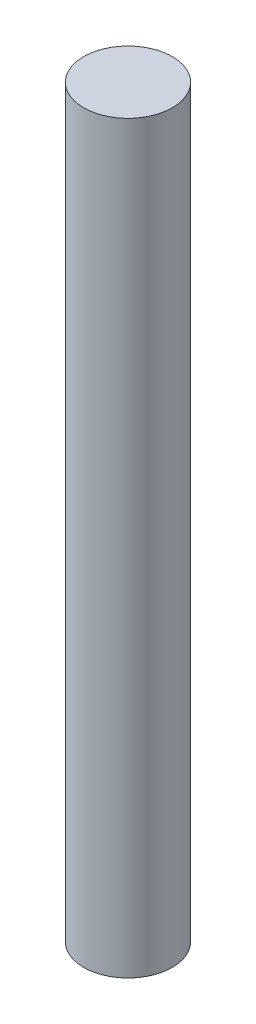
ISO-10303-21;
HEADER;
FILE_DESCRIPTION(('STEP AP214'),'2;1');
FILE_NAME('part.step','',(''),(''),'','','');
FILE_SCHEMA(('AUTOMOTIVE_DESIGN { 1 0 10303 214 1 1 1 1 }'));
ENDSEC;
DATA;
#1=APPLICATION_CONTEXT('core data for automotive mechanical design processes');
#2=APPLICATION_PROTOCOL_DEFINITION('international standard','automotive_design',2000,#1);
#3=PRODUCT_CONTEXT('',#1,'mechanical');
#4=PRODUCT('Part','Part','',(#3));
#5=PRODUCT_RELATED_PRODUCT_CATEGORY('part','',(#4));
#6=PRODUCT_DEFINITION_FORMATION('','',#4);
#7=PRODUCT_DEFINITION_CONTEXT('part definition',#1,'design');
#8=PRODUCT_DEFINITION('design','',#6,#7);
#9=PRODUCT_DEFINITION_SHAPE('','',#8);
#10=(LENGTH_UNIT() NAMED_UNIT(*) SI_UNIT(.MILLI.,.METRE.));
#11=(NAMED_UNIT(*) PLANE_ANGLE_UNIT() SI_UNIT($,.RADIAN.));
#12=(NAMED_UNIT(*) SI_UNIT($,.STERADIAN.) SOLID_ANGLE_UNIT());
#13=UNCERTAINTY_MEASURE_WITH_UNIT(LENGTH_MEASURE(1.E-05),#10,'distance_accuracy_value','');
#14=(GEOMETRIC_REPRESENTATION_CONTEXT(3) GLOBAL_UNCERTAINTY_ASSIGNED_CONTEXT((#13)) GLOBAL_UNIT_ASSIGNED_CONTEXT((#10,
#11,#12)) REPRESENTATION_CONTEXT('',''));
#15=CARTESIAN_POINT('',(0.,0.,0.));
#16=DIRECTION('',(0.,0.,1.));
#17=DIRECTION('',(1.,0.,0.));
#18=AXIS2_PLACEMENT_3D('',#15,#16,#17);
#19=CARTESIAN_POINT('',(0.,-13.,0.));
#20=DIRECTION('',(0.,1.,0.));
#21=DIRECTION('',(0.,0.,1.));
#22=AXIS2_PLACEMENT_3D('',#19,#20,#21);
#23=CYLINDRICAL_SURFACE('',#22,2.5);
#24=CARTESIAN_POINT('',(0.,-13.,0.));
#25=DIRECTION('',(0.,1.,0.));
#26=DIRECTION('',(0.,0.,1.));
#27=AXIS2_PLACEMENT_3D('',#24,#25,#26);
#28=CIRCLE('',#27,2.5);
#29=CARTESIAN_POINT('',(0.,-13.,2.5));
#30=VERTEX_POINT('',#29);
#31=EDGE_CURVE('E10',#30,#30,#28,.T.);
#32=ORIENTED_EDGE('',*,*,#31,.T.);
#33=EDGE_LOOP('',(#32));
#34=FACE_BOUND('',#33,.T.);
#35=CARTESIAN_POINT('',(0.,29.,0.));
#36=DIRECTION('',(0.,1.,0.));
#37=DIRECTION('',(0.,0.,1.));
#38=AXIS2_PLACEMENT_3D('',#35,#36,#37);
#39=CIRCLE('',#38,2.5);
#40=CARTESIAN_POINT('',(0.,29.,2.5));
#41=VERTEX_POINT('',#40);
#42=EDGE_CURVE('E36',#41,#41,#39,.T.);
#43=ORIENTED_EDGE('',*,*,#42,.F.);
#44=EDGE_LOOP('',(#43));
#45=FACE_BOUND('',#44,.T.);
#46=ADVANCED_FACE('F30',(#34,#45),#23,.T.);
#47=CARTESIAN_POINT('',(0.,-13.,0.));
#48=DIRECTION('',(0.,1.,0.));
#49=DIRECTION('',(0.,0.,1.));
#50=AXIS2_PLACEMENT_3D('',#47,#48,#49);
#51=PLANE('',#50);
#52=ORIENTED_EDGE('',*,*,#31,.F.);
#53=EDGE_LOOP('',(#52));
#54=FACE_BOUND('',#53,.T.);
#55=ADVANCED_FACE('F45',(#54),#51,.F.);
#56=CARTESIAN_POINT('',(0.,29.,0.));
#57=DIRECTION('',(0.,1.,0.));
#58=DIRECTION('',(0.,0.,1.));
#59=AXIS2_PLACEMENT_3D('',#56,#57,#58);
#60=PLANE('',#59);
#61=ORIENTED_EDGE('',*,*,#42,.T.);
#62=EDGE_LOOP('',(#61));
#63=FACE_BOUND('',#62,.T.);
#64=ADVANCED_FACE('F42',(#63),#60,.T.);
#65=CLOSED_SHELL('',(#46,#55,#64));
#66=MANIFOLD_SOLID_BREP('B2',#65);
#67=ADVANCED_BREP_SHAPE_REPRESENTATION('',(#18,#66),#14);
#68=SHAPE_DEFINITION_REPRESENTATION(#9,#67);
ENDSEC;
END-ISO-10303-21;
